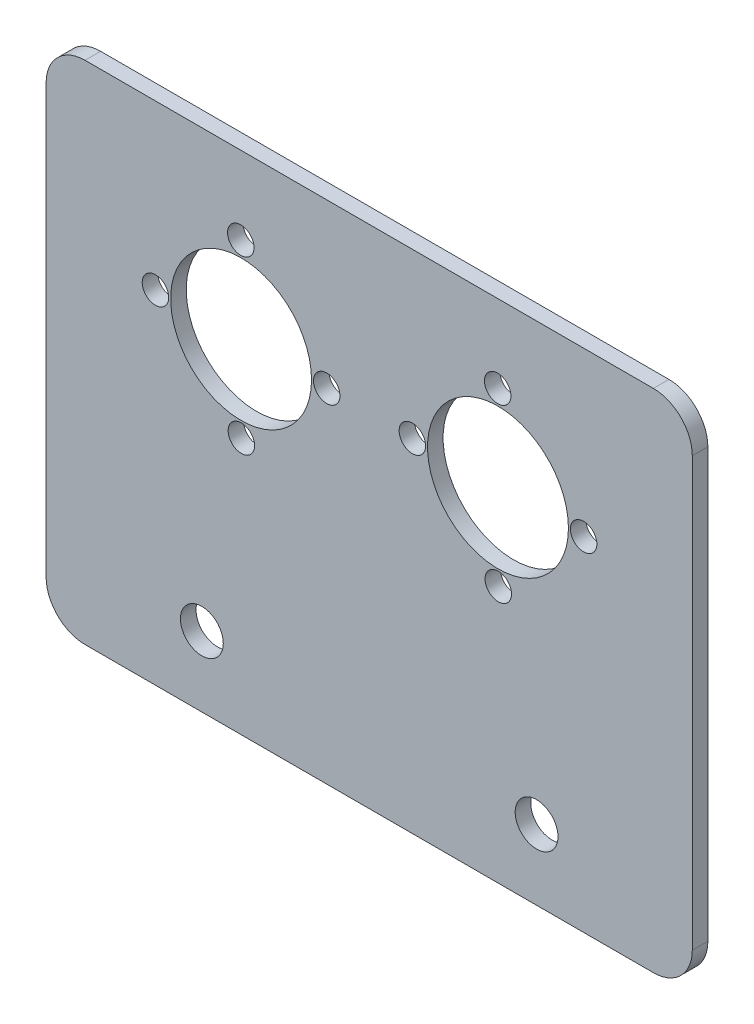
ISO-10303-21;
HEADER;
FILE_DESCRIPTION(('STEP AP214'),'2;1');
FILE_NAME('part.step','',(''),(''),'','','');
FILE_SCHEMA(('AUTOMOTIVE_DESIGN { 1 0 10303 214 1 1 1 1 }'));
ENDSEC;
DATA;
#1=APPLICATION_CONTEXT('core data for automotive mechanical design processes');
#2=APPLICATION_PROTOCOL_DEFINITION('international standard','automotive_design',2000,#1);
#3=PRODUCT_CONTEXT('',#1,'mechanical');
#4=PRODUCT('Part','Part','',(#3));
#5=PRODUCT_RELATED_PRODUCT_CATEGORY('part','',(#4));
#6=PRODUCT_DEFINITION_FORMATION('','',#4);
#7=PRODUCT_DEFINITION_CONTEXT('part definition',#1,'design');
#8=PRODUCT_DEFINITION('design','',#6,#7);
#9=PRODUCT_DEFINITION_SHAPE('','',#8);
#10=(LENGTH_UNIT() NAMED_UNIT(*) SI_UNIT(.MILLI.,.METRE.));
#11=(NAMED_UNIT(*) PLANE_ANGLE_UNIT() SI_UNIT($,.RADIAN.));
#12=(NAMED_UNIT(*) SI_UNIT($,.STERADIAN.) SOLID_ANGLE_UNIT());
#13=UNCERTAINTY_MEASURE_WITH_UNIT(LENGTH_MEASURE(1.E-05),#10,'distance_accuracy_value','');
#14=(GEOMETRIC_REPRESENTATION_CONTEXT(3) GLOBAL_UNCERTAINTY_ASSIGNED_CONTEXT((#13)) GLOBAL_UNIT_ASSIGNED_CONTEXT((#10,
#11,#12)) REPRESENTATION_CONTEXT('',''));
#15=CARTESIAN_POINT('',(0.,0.,0.));
#16=DIRECTION('',(0.,0.,1.));
#17=DIRECTION('',(1.,0.,0.));
#18=AXIS2_PLACEMENT_3D('',#15,#16,#17);
#19=CARTESIAN_POINT('',(41.5,-32.5,-2.));
#20=DIRECTION('',(1.,0.,0.));
#21=DIRECTION('',(0.,0.,-1.));
#22=AXIS2_PLACEMENT_3D('',#19,#20,#21);
#23=PLANE('',#22);
#24=DIRECTION('',(0.,1.,0.));
#25=VECTOR('',#24,1.);
#26=CARTESIAN_POINT('',(41.5,-32.5,0.));
#27=LINE('',#26,#25);
#28=CARTESIAN_POINT('',(41.5,-27.5,0.));
#29=VERTEX_POINT('',#28);
#30=CARTESIAN_POINT('',(41.5,27.5,0.));
#31=VERTEX_POINT('',#30);
#32=EDGE_CURVE('E158',#29,#31,#27,.T.);
#33=ORIENTED_EDGE('',*,*,#32,.F.);
#34=DIRECTION('',(0.,0.,1.));
#35=VECTOR('',#34,1.);
#36=CARTESIAN_POINT('',(41.5,-27.5,-2.));
#37=LINE('',#36,#35);
#38=CARTESIAN_POINT('',(41.5,-27.5,-2.));
#39=VERTEX_POINT('',#38);
#40=EDGE_CURVE('E149',#29,#39,#37,.F.);
#41=ORIENTED_EDGE('',*,*,#40,.T.);
#42=DIRECTION('',(0.,1.,0.));
#43=VECTOR('',#42,1.);
#44=CARTESIAN_POINT('',(41.5,-32.5,-2.));
#45=LINE('',#44,#43);
#46=CARTESIAN_POINT('',(41.5,27.5,-2.));
#47=VERTEX_POINT('',#46);
#48=EDGE_CURVE('E155',#39,#47,#45,.T.);
#49=ORIENTED_EDGE('',*,*,#48,.T.);
#50=DIRECTION('',(0.,0.,1.));
#51=VECTOR('',#50,1.);
#52=CARTESIAN_POINT('',(41.5,27.5,-2.));
#53=LINE('',#52,#51);
#54=EDGE_CURVE('E146',#47,#31,#53,.T.);
#55=ORIENTED_EDGE('',*,*,#54,.T.);
#56=EDGE_LOOP('',(#33,#41,#49,#55));
#57=FACE_BOUND('',#56,.T.);
#58=ADVANCED_FACE('F35',(#57),#23,.T.);
#59=CARTESIAN_POINT('',(-41.5,-32.5,-2.));
#60=DIRECTION('',(0.,-1.,0.));
#61=DIRECTION('',(0.,0.,-1.));
#62=AXIS2_PLACEMENT_3D('',#59,#60,#61);
#63=PLANE('',#62);
#64=DIRECTION('',(1.,0.,0.));
#65=VECTOR('',#64,1.);
#66=CARTESIAN_POINT('',(-41.5,-32.5,0.));
#67=LINE('',#66,#65);
#68=CARTESIAN_POINT('',(-36.5,-32.5,0.));
#69=VERTEX_POINT('',#68);
#70=CARTESIAN_POINT('',(36.5,-32.5,0.));
#71=VERTEX_POINT('',#70);
#72=EDGE_CURVE('E119',#69,#71,#67,.T.);
#73=ORIENTED_EDGE('',*,*,#72,.F.);
#74=DIRECTION('',(0.,0.,1.));
#75=VECTOR('',#74,1.);
#76=CARTESIAN_POINT('',(-36.5,-32.5,-2.));
#77=LINE('',#76,#75);
#78=CARTESIAN_POINT('',(-36.5,-32.5,-2.));
#79=VERTEX_POINT('',#78);
#80=EDGE_CURVE('E137',#69,#79,#77,.F.);
#81=ORIENTED_EDGE('',*,*,#80,.T.);
#82=DIRECTION('',(1.,0.,0.));
#83=VECTOR('',#82,1.);
#84=CARTESIAN_POINT('',(-41.5,-32.5,-2.));
#85=LINE('',#84,#83);
#86=CARTESIAN_POINT('',(36.5,-32.5,-2.));
#87=VERTEX_POINT('',#86);
#88=EDGE_CURVE('E122',#79,#87,#85,.T.);
#89=ORIENTED_EDGE('',*,*,#88,.T.);
#90=DIRECTION('',(0.,0.,1.));
#91=VECTOR('',#90,1.);
#92=CARTESIAN_POINT('',(36.5,-32.5,-2.));
#93=LINE('',#92,#91);
#94=EDGE_CURVE('E134',#87,#71,#93,.T.);
#95=ORIENTED_EDGE('',*,*,#94,.T.);
#96=EDGE_LOOP('',(#73,#81,#89,#95));
#97=FACE_BOUND('',#96,.T.);
#98=ADVANCED_FACE('F171',(#97),#63,.T.);
#99=CARTESIAN_POINT('',(-41.5,-32.5,-2.));
#100=DIRECTION('',(-1.,0.,0.));
#101=DIRECTION('',(0.,0.,1.));
#102=AXIS2_PLACEMENT_3D('',#99,#100,#101);
#103=PLANE('',#102);
#104=DIRECTION('',(0.,-1.,0.));
#105=VECTOR('',#104,1.);
#106=CARTESIAN_POINT('',(-41.5,-32.5,-2.));
#107=LINE('',#106,#105);
#108=CARTESIAN_POINT('',(-41.5,27.5,-2.));
#109=VERTEX_POINT('',#108);
#110=CARTESIAN_POINT('',(-41.5,-27.5,-2.));
#111=VERTEX_POINT('',#110);
#112=EDGE_CURVE('E126',#109,#111,#107,.T.);
#113=ORIENTED_EDGE('',*,*,#112,.T.);
#114=DIRECTION('',(0.,0.,1.));
#115=VECTOR('',#114,1.);
#116=CARTESIAN_POINT('',(-41.5,-27.5,-2.));
#117=LINE('',#116,#115);
#118=CARTESIAN_POINT('',(-41.5,-27.5,0.));
#119=VERTEX_POINT('',#118);
#120=EDGE_CURVE('E118',#111,#119,#117,.T.);
#121=ORIENTED_EDGE('',*,*,#120,.T.);
#122=DIRECTION('',(0.,-1.,0.));
#123=VECTOR('',#122,1.);
#124=CARTESIAN_POINT('',(-41.5,-32.5,0.));
#125=LINE('',#124,#123);
#126=CARTESIAN_POINT('',(-41.5,27.5,0.));
#127=VERTEX_POINT('',#126);
#128=EDGE_CURVE('E104',#127,#119,#125,.T.);
#129=ORIENTED_EDGE('',*,*,#128,.F.);
#130=DIRECTION('',(0.,0.,1.));
#131=VECTOR('',#130,1.);
#132=CARTESIAN_POINT('',(-41.5,27.5,-2.));
#133=LINE('',#132,#131);
#134=EDGE_CURVE('E116',#127,#109,#133,.F.);
#135=ORIENTED_EDGE('',*,*,#134,.T.);
#136=EDGE_LOOP('',(#113,#121,#129,#135));
#137=FACE_BOUND('',#136,.T.);
#138=ADVANCED_FACE('F115',(#137),#103,.T.);
#139=CARTESIAN_POINT('',(-41.5,32.5,-2.));
#140=DIRECTION('',(0.,1.,0.));
#141=DIRECTION('',(0.,0.,1.));
#142=AXIS2_PLACEMENT_3D('',#139,#140,#141);
#143=PLANE('',#142);
#144=DIRECTION('',(-1.,0.,0.));
#145=VECTOR('',#144,1.);
#146=CARTESIAN_POINT('',(-41.5,32.5,-2.));
#147=LINE('',#146,#145);
#148=CARTESIAN_POINT('',(36.5,32.5,-2.));
#149=VERTEX_POINT('',#148);
#150=CARTESIAN_POINT('',(-36.5,32.5,-2.));
#151=VERTEX_POINT('',#150);
#152=EDGE_CURVE('E164',#149,#151,#147,.T.);
#153=ORIENTED_EDGE('',*,*,#152,.T.);
#154=DIRECTION('',(0.,0.,1.));
#155=VECTOR('',#154,1.);
#156=CARTESIAN_POINT('',(-36.5,32.5,-2.));
#157=LINE('',#156,#155);
#158=CARTESIAN_POINT('',(-36.5,32.5,0.));
#159=VERTEX_POINT('',#158);
#160=EDGE_CURVE('E11',#151,#159,#157,.T.);
#161=ORIENTED_EDGE('',*,*,#160,.T.);
#162=DIRECTION('',(-1.,0.,0.));
#163=VECTOR('',#162,1.);
#164=CARTESIAN_POINT('',(-41.5,32.5,0.));
#165=LINE('',#164,#163);
#166=CARTESIAN_POINT('',(36.5,32.5,0.));
#167=VERTEX_POINT('',#166);
#168=EDGE_CURVE('E105',#167,#159,#165,.T.);
#169=ORIENTED_EDGE('',*,*,#168,.F.);
#170=DIRECTION('',(0.,0.,1.));
#171=VECTOR('',#170,1.);
#172=CARTESIAN_POINT('',(36.5,32.5,-2.));
#173=LINE('',#172,#171);
#174=EDGE_CURVE('E43',#167,#149,#173,.F.);
#175=ORIENTED_EDGE('',*,*,#174,.T.);
#176=EDGE_LOOP('',(#153,#161,#169,#175));
#177=FACE_BOUND('',#176,.T.);
#178=ADVANCED_FACE('F310',(#177),#143,.T.);
#179=CARTESIAN_POINT('',(0.,0.,-2.));
#180=DIRECTION('',(0.,0.,-1.));
#181=DIRECTION('',(-1.,0.,0.));
#182=AXIS2_PLACEMENT_3D('',#179,#180,#181);
#183=PLANE('',#182);
#184=CARTESIAN_POINT('',(21.5000000000001,-23.499999999983,-2.));
#185=DIRECTION('',(0.,0.,1.));
#186=DIRECTION('',(1.,0.,0.));
#187=AXIS2_PLACEMENT_3D('',#184,#185,#186);
#188=CIRCLE('',#187,2.75);
#189=CARTESIAN_POINT('',(24.2500000000001,-23.499999999983,-2.));
#190=VERTEX_POINT('',#189);
#191=EDGE_CURVE('E255',#190,#190,#188,.T.);
#192=ORIENTED_EDGE('',*,*,#191,.T.);
#193=EDGE_LOOP('',(#192));
#194=FACE_BOUND('',#193,.T.);
#195=CARTESIAN_POINT('',(-21.4969384566987,-23.499999999983,-2.));
#196=DIRECTION('',(0.,0.,1.));
#197=DIRECTION('',(1.,0.,0.));
#198=AXIS2_PLACEMENT_3D('',#195,#196,#197);
#199=CIRCLE('',#198,2.75);
#200=CARTESIAN_POINT('',(-18.7469384566987,-23.499999999983,-2.));
#201=VERTEX_POINT('',#200);
#202=EDGE_CURVE('E249',#201,#201,#199,.T.);
#203=ORIENTED_EDGE('',*,*,#202,.T.);
#204=EDGE_LOOP('',(#203));
#205=FACE_BOUND('',#204,.T.);
#206=CARTESIAN_POINT('',(-5.45897903742142,11.5358726856039,-2.));
#207=DIRECTION('',(0.,0.,1.));
#208=DIRECTION('',(1.,0.,0.));
#209=AXIS2_PLACEMENT_3D('',#206,#207,#208);
#210=CIRCLE('',#209,1.7);
#211=CARTESIAN_POINT('',(-3.75897903742142,11.5358726856039,-2.));
#212=VERTEX_POINT('',#211);
#213=EDGE_CURVE('E246',#212,#212,#210,.T.);
#214=ORIENTED_EDGE('',*,*,#213,.T.);
#215=EDGE_LOOP('',(#214));
#216=FACE_BOUND('',#215,.T.);
#217=CARTESIAN_POINT('',(-27.4588620507858,11.4641273144426,-2.));
#218=DIRECTION('',(0.,0.,1.));
#219=DIRECTION('',(1.,0.,0.));
#220=AXIS2_PLACEMENT_3D('',#217,#218,#219);
#221=CIRCLE('',#220,1.7);
#222=CARTESIAN_POINT('',(-25.7588620507858,11.4641273144426,-2.));
#223=VERTEX_POINT('',#222);
#224=EDGE_CURVE('E240',#223,#223,#221,.T.);
#225=ORIENTED_EDGE('',*,*,#224,.T.);
#226=EDGE_LOOP('',(#225));
#227=FACE_BOUND('',#226,.T.);
#228=CARTESIAN_POINT('',(-16.4230478585229,0.500058493341093,-2.));
#229=DIRECTION('',(0.,0.,1.));
#230=DIRECTION('',(1.,0.,0.));
#231=AXIS2_PLACEMENT_3D('',#228,#229,#230);
#232=CIRCLE('',#231,1.7);
#233=CARTESIAN_POINT('',(-14.7230478585229,0.500058493341093,-2.));
#234=VERTEX_POINT('',#233);
#235=EDGE_CURVE('E234',#234,#234,#232,.T.);
#236=ORIENTED_EDGE('',*,*,#235,.T.);
#237=EDGE_LOOP('',(#236));
#238=FACE_BOUND('',#237,.T.);
#239=CARTESIAN_POINT('',(-16.4947932296842,22.4999415067054,-2.));
#240=DIRECTION('',(0.,0.,1.));
#241=DIRECTION('',(1.,0.,0.));
#242=AXIS2_PLACEMENT_3D('',#239,#240,#241);
#243=CIRCLE('',#242,1.7);
#244=CARTESIAN_POINT('',(-14.7947932296842,22.4999415067054,-2.));
#245=VERTEX_POINT('',#244);
#246=EDGE_CURVE('E228',#245,#245,#243,.T.);
#247=ORIENTED_EDGE('',*,*,#246,.T.);
#248=EDGE_LOOP('',(#247));
#249=FACE_BOUND('',#248,.T.);
#250=CARTESIAN_POINT('',(16.5052067703158,22.4999415067054,-2.));
#251=DIRECTION('',(0.,0.,1.));
#252=DIRECTION('',(1.,0.,0.));
#253=AXIS2_PLACEMENT_3D('',#250,#251,#252);
#254=CIRCLE('',#253,1.7);
#255=CARTESIAN_POINT('',(18.2052067703158,22.4999415067054,-2.));
#256=VERTEX_POINT('',#255);
#257=EDGE_CURVE('E219',#256,#256,#254,.T.);
#258=ORIENTED_EDGE('',*,*,#257,.T.);
#259=EDGE_LOOP('',(#258));
#260=FACE_BOUND('',#259,.T.);
#261=CARTESIAN_POINT('',(27.5410209625786,11.5358726856039,-2.));
#262=DIRECTION('',(0.,0.,1.));
#263=DIRECTION('',(1.,0.,0.));
#264=AXIS2_PLACEMENT_3D('',#261,#262,#263);
#265=CIRCLE('',#264,1.7);
#266=CARTESIAN_POINT('',(29.2410209625786,11.5358726856039,-2.));
#267=VERTEX_POINT('',#266);
#268=EDGE_CURVE('E213',#267,#267,#265,.T.);
#269=ORIENTED_EDGE('',*,*,#268,.T.);
#270=EDGE_LOOP('',(#269));
#271=FACE_BOUND('',#270,.T.);
#272=CARTESIAN_POINT('',(5.54113794921425,11.4641273144426,-2.));
#273=DIRECTION('',(0.,0.,1.));
#274=DIRECTION('',(1.,0.,0.));
#275=AXIS2_PLACEMENT_3D('',#272,#273,#274);
#276=CIRCLE('',#275,1.7);
#277=CARTESIAN_POINT('',(7.24113794921425,11.4641273144426,-2.));
#278=VERTEX_POINT('',#277);
#279=EDGE_CURVE('E204',#278,#278,#276,.T.);
#280=ORIENTED_EDGE('',*,*,#279,.T.);
#281=EDGE_LOOP('',(#280));
#282=FACE_BOUND('',#281,.T.);
#283=CARTESIAN_POINT('',(16.5769521414771,0.500058493341093,-2.));
#284=DIRECTION('',(0.,0.,1.));
#285=DIRECTION('',(1.,0.,0.));
#286=AXIS2_PLACEMENT_3D('',#283,#284,#285);
#287=CIRCLE('',#286,1.7);
#288=CARTESIAN_POINT('',(18.2769521414771,0.500058493341093,-2.));
#289=VERTEX_POINT('',#288);
#290=EDGE_CURVE('E190',#289,#289,#287,.T.);
#291=ORIENTED_EDGE('',*,*,#290,.T.);
#292=EDGE_LOOP('',(#291));
#293=FACE_BOUND('',#292,.T.);
#294=CARTESIAN_POINT('',(16.5410794558972,11.5000000000059,-2.));
#295=DIRECTION('',(0.,0.,1.));
#296=DIRECTION('',(1.,0.,0.));
#297=AXIS2_PLACEMENT_3D('',#294,#295,#296);
#298=CIRCLE('',#297,9.05);
#299=CARTESIAN_POINT('',(25.5910794558972,11.5000000000059,-2.));
#300=VERTEX_POINT('',#299);
#301=EDGE_CURVE('E180',#300,#300,#298,.T.);
#302=ORIENTED_EDGE('',*,*,#301,.T.);
#303=EDGE_LOOP('',(#302));
#304=FACE_BOUND('',#303,.T.);
#305=CARTESIAN_POINT('',(-16.4589205441028,11.500000000006,-2.));
#306=DIRECTION('',(0.,0.,1.));
#307=DIRECTION('',(1.,0.,0.));
#308=AXIS2_PLACEMENT_3D('',#305,#306,#307);
#309=CIRCLE('',#308,9.05);
#310=CARTESIAN_POINT('',(-7.40892054410283,11.500000000006,-2.));
#311=VERTEX_POINT('',#310);
#312=EDGE_CURVE('E187',#311,#311,#309,.T.);
#313=ORIENTED_EDGE('',*,*,#312,.T.);
#314=EDGE_LOOP('',(#313));
#315=FACE_BOUND('',#314,.T.);
#316=ORIENTED_EDGE('',*,*,#88,.F.);
#317=CARTESIAN_POINT('',(-36.5,-27.5,-2.));
#318=DIRECTION('',(0.,0.,-1.));
#319=DIRECTION('',(-1.,0.,0.));
#320=AXIS2_PLACEMENT_3D('',#317,#318,#319);
#321=CIRCLE('',#320,5.);
#322=EDGE_CURVE('E144',#79,#111,#321,.T.);
#323=ORIENTED_EDGE('',*,*,#322,.T.);
#324=ORIENTED_EDGE('',*,*,#112,.F.);
#325=CARTESIAN_POINT('',(-36.5,27.5,-2.));
#326=DIRECTION('',(0.,0.,-1.));
#327=DIRECTION('',(-1.,0.,0.));
#328=AXIS2_PLACEMENT_3D('',#325,#326,#327);
#329=CIRCLE('',#328,5.);
#330=EDGE_CURVE('E50',#109,#151,#329,.T.);
#331=ORIENTED_EDGE('',*,*,#330,.T.);
#332=ORIENTED_EDGE('',*,*,#152,.F.);
#333=CARTESIAN_POINT('',(36.5,27.5,-2.));
#334=DIRECTION('',(0.,0.,-1.));
#335=DIRECTION('',(-1.,0.,0.));
#336=AXIS2_PLACEMENT_3D('',#333,#334,#335);
#337=CIRCLE('',#336,5.);
#338=EDGE_CURVE('E139',#149,#47,#337,.T.);
#339=ORIENTED_EDGE('',*,*,#338,.T.);
#340=ORIENTED_EDGE('',*,*,#48,.F.);
#341=CARTESIAN_POINT('',(36.5,-27.5,-2.));
#342=DIRECTION('',(0.,0.,-1.));
#343=DIRECTION('',(-1.,0.,0.));
#344=AXIS2_PLACEMENT_3D('',#341,#342,#343);
#345=CIRCLE('',#344,5.);
#346=EDGE_CURVE('E142',#39,#87,#345,.T.);
#347=ORIENTED_EDGE('',*,*,#346,.T.);
#348=EDGE_LOOP('',(#316,#323,#324,#331,#332,#339,#340,#347));
#349=FACE_BOUND('',#348,.T.);
#350=ADVANCED_FACE('F162',(#194,#205,#216,#227,#238,#249,#260,#271,#282,#293,#304,#315,#349),
#183,.T.);
#351=CARTESIAN_POINT('',(0.,0.,0.));
#352=DIRECTION('',(0.,0.,-1.));
#353=DIRECTION('',(-1.,0.,0.));
#354=AXIS2_PLACEMENT_3D('',#351,#352,#353);
#355=PLANE('',#354);
#356=CARTESIAN_POINT('',(21.5000000000001,-23.499999999983,0.));
#357=DIRECTION('',(0.,0.,1.));
#358=DIRECTION('',(1.,0.,0.));
#359=AXIS2_PLACEMENT_3D('',#356,#357,#358);
#360=CIRCLE('',#359,2.75);
#361=CARTESIAN_POINT('',(24.2500000000001,-23.499999999983,0.));
#362=VERTEX_POINT('',#361);
#363=EDGE_CURVE('E258',#362,#362,#360,.T.);
#364=ORIENTED_EDGE('',*,*,#363,.F.);
#365=EDGE_LOOP('',(#364));
#366=FACE_BOUND('',#365,.T.);
#367=CARTESIAN_POINT('',(-21.4969384566987,-23.499999999983,0.));
#368=DIRECTION('',(0.,0.,1.));
#369=DIRECTION('',(1.,0.,0.));
#370=AXIS2_PLACEMENT_3D('',#367,#368,#369);
#371=CIRCLE('',#370,2.75);
#372=CARTESIAN_POINT('',(-18.7469384566987,-23.499999999983,0.));
#373=VERTEX_POINT('',#372);
#374=EDGE_CURVE('E252',#373,#373,#371,.T.);
#375=ORIENTED_EDGE('',*,*,#374,.F.);
#376=EDGE_LOOP('',(#375));
#377=FACE_BOUND('',#376,.T.);
#378=CARTESIAN_POINT('',(-5.45897903742142,11.5358726856039,0.));
#379=DIRECTION('',(0.,0.,1.));
#380=DIRECTION('',(1.,0.,0.));
#381=AXIS2_PLACEMENT_3D('',#378,#379,#380);
#382=CIRCLE('',#381,1.7);
#383=CARTESIAN_POINT('',(-3.75897903742142,11.5358726856039,0.));
#384=VERTEX_POINT('',#383);
#385=EDGE_CURVE('E243',#384,#384,#382,.T.);
#386=ORIENTED_EDGE('',*,*,#385,.F.);
#387=EDGE_LOOP('',(#386));
#388=FACE_BOUND('',#387,.T.);
#389=CARTESIAN_POINT('',(-27.4588620507858,11.4641273144426,0.));
#390=DIRECTION('',(0.,0.,1.));
#391=DIRECTION('',(1.,0.,0.));
#392=AXIS2_PLACEMENT_3D('',#389,#390,#391);
#393=CIRCLE('',#392,1.7);
#394=CARTESIAN_POINT('',(-25.7588620507858,11.4641273144426,0.));
#395=VERTEX_POINT('',#394);
#396=EDGE_CURVE('E237',#395,#395,#393,.T.);
#397=ORIENTED_EDGE('',*,*,#396,.F.);
#398=EDGE_LOOP('',(#397));
#399=FACE_BOUND('',#398,.T.);
#400=CARTESIAN_POINT('',(-16.4230478585229,0.500058493341093,0.));
#401=DIRECTION('',(0.,0.,1.));
#402=DIRECTION('',(1.,0.,0.));
#403=AXIS2_PLACEMENT_3D('',#400,#401,#402);
#404=CIRCLE('',#403,1.7);
#405=CARTESIAN_POINT('',(-14.7230478585229,0.500058493341093,0.));
#406=VERTEX_POINT('',#405);
#407=EDGE_CURVE('E231',#406,#406,#404,.T.);
#408=ORIENTED_EDGE('',*,*,#407,.F.);
#409=EDGE_LOOP('',(#408));
#410=FACE_BOUND('',#409,.T.);
#411=CARTESIAN_POINT('',(-16.4947932296842,22.4999415067054,0.));
#412=DIRECTION('',(0.,0.,1.));
#413=DIRECTION('',(1.,0.,0.));
#414=AXIS2_PLACEMENT_3D('',#411,#412,#413);
#415=CIRCLE('',#414,1.7);
#416=CARTESIAN_POINT('',(-14.7947932296842,22.4999415067054,0.));
#417=VERTEX_POINT('',#416);
#418=EDGE_CURVE('E225',#417,#417,#415,.T.);
#419=ORIENTED_EDGE('',*,*,#418,.F.);
#420=EDGE_LOOP('',(#419));
#421=FACE_BOUND('',#420,.T.);
#422=CARTESIAN_POINT('',(16.5052067703158,22.4999415067054,0.));
#423=DIRECTION('',(0.,0.,1.));
#424=DIRECTION('',(1.,0.,0.));
#425=AXIS2_PLACEMENT_3D('',#422,#423,#424);
#426=CIRCLE('',#425,1.7);
#427=CARTESIAN_POINT('',(18.2052067703158,22.4999415067054,0.));
#428=VERTEX_POINT('',#427);
#429=EDGE_CURVE('E222',#428,#428,#426,.T.);
#430=ORIENTED_EDGE('',*,*,#429,.F.);
#431=EDGE_LOOP('',(#430));
#432=FACE_BOUND('',#431,.T.);
#433=CARTESIAN_POINT('',(27.5410209625786,11.5358726856039,0.));
#434=DIRECTION('',(0.,0.,1.));
#435=DIRECTION('',(1.,0.,0.));
#436=AXIS2_PLACEMENT_3D('',#433,#434,#435);
#437=CIRCLE('',#436,1.7);
#438=CARTESIAN_POINT('',(29.2410209625786,11.5358726856039,0.));
#439=VERTEX_POINT('',#438);
#440=EDGE_CURVE('E216',#439,#439,#437,.T.);
#441=ORIENTED_EDGE('',*,*,#440,.F.);
#442=EDGE_LOOP('',(#441));
#443=FACE_BOUND('',#442,.T.);
#444=CARTESIAN_POINT('',(5.54113794921425,11.4641273144426,0.));
#445=DIRECTION('',(0.,0.,1.));
#446=DIRECTION('',(1.,0.,0.));
#447=AXIS2_PLACEMENT_3D('',#444,#445,#446);
#448=CIRCLE('',#447,1.7);
#449=CARTESIAN_POINT('',(7.24113794921425,11.4641273144426,0.));
#450=VERTEX_POINT('',#449);
#451=EDGE_CURVE('E208',#450,#450,#448,.T.);
#452=ORIENTED_EDGE('',*,*,#451,.F.);
#453=EDGE_LOOP('',(#452));
#454=FACE_BOUND('',#453,.T.);
#455=CARTESIAN_POINT('',(16.5769521414771,0.500058493341093,0.));
#456=DIRECTION('',(0.,0.,1.));
#457=DIRECTION('',(1.,0.,0.));
#458=AXIS2_PLACEMENT_3D('',#455,#456,#457);
#459=CIRCLE('',#458,1.7);
#460=CARTESIAN_POINT('',(18.2769521414771,0.500058493341093,0.));
#461=VERTEX_POINT('',#460);
#462=EDGE_CURVE('E200',#461,#461,#459,.T.);
#463=ORIENTED_EDGE('',*,*,#462,.F.);
#464=EDGE_LOOP('',(#463));
#465=FACE_BOUND('',#464,.T.);
#466=CARTESIAN_POINT('',(16.5410794558972,11.5000000000059,0.));
#467=DIRECTION('',(0.,0.,1.));
#468=DIRECTION('',(1.,0.,0.));
#469=AXIS2_PLACEMENT_3D('',#466,#467,#468);
#470=CIRCLE('',#469,9.05);
#471=CARTESIAN_POINT('',(25.5910794558972,11.5000000000059,0.));
#472=VERTEX_POINT('',#471);
#473=EDGE_CURVE('E182',#472,#472,#470,.T.);
#474=ORIENTED_EDGE('',*,*,#473,.F.);
#475=EDGE_LOOP('',(#474));
#476=FACE_BOUND('',#475,.T.);
#477=CARTESIAN_POINT('',(-16.4589205441028,11.500000000006,0.));
#478=DIRECTION('',(0.,0.,1.));
#479=DIRECTION('',(1.,0.,0.));
#480=AXIS2_PLACEMENT_3D('',#477,#478,#479);
#481=CIRCLE('',#480,9.05);
#482=CARTESIAN_POINT('',(-7.40892054410283,11.500000000006,0.));
#483=VERTEX_POINT('',#482);
#484=EDGE_CURVE('E195',#483,#483,#481,.T.);
#485=ORIENTED_EDGE('',*,*,#484,.F.);
#486=EDGE_LOOP('',(#485));
#487=FACE_BOUND('',#486,.T.);
#488=ORIENTED_EDGE('',*,*,#128,.T.);
#489=CARTESIAN_POINT('',(-36.5,-27.5,0.));
#490=DIRECTION('',(0.,0.,-1.));
#491=DIRECTION('',(-1.,0.,0.));
#492=AXIS2_PLACEMENT_3D('',#489,#490,#491);
#493=CIRCLE('',#492,5.);
#494=EDGE_CURVE('E132',#119,#69,#493,.F.);
#495=ORIENTED_EDGE('',*,*,#494,.T.);
#496=ORIENTED_EDGE('',*,*,#72,.T.);
#497=CARTESIAN_POINT('',(36.5,-27.5,0.));
#498=DIRECTION('',(0.,0.,-1.));
#499=DIRECTION('',(-1.,0.,0.));
#500=AXIS2_PLACEMENT_3D('',#497,#498,#499);
#501=CIRCLE('',#500,5.);
#502=EDGE_CURVE('E109',#71,#29,#501,.F.);
#503=ORIENTED_EDGE('',*,*,#502,.T.);
#504=ORIENTED_EDGE('',*,*,#32,.T.);
#505=CARTESIAN_POINT('',(36.5,27.5,0.));
#506=DIRECTION('',(0.,0.,-1.));
#507=DIRECTION('',(-1.,0.,0.));
#508=AXIS2_PLACEMENT_3D('',#505,#506,#507);
#509=CIRCLE('',#508,5.);
#510=EDGE_CURVE('E110',#31,#167,#509,.F.);
#511=ORIENTED_EDGE('',*,*,#510,.T.);
#512=ORIENTED_EDGE('',*,*,#168,.T.);
#513=CARTESIAN_POINT('',(-36.5,27.5,0.));
#514=DIRECTION('',(0.,0.,-1.));
#515=DIRECTION('',(-1.,0.,0.));
#516=AXIS2_PLACEMENT_3D('',#513,#514,#515);
#517=CIRCLE('',#516,5.);
#518=EDGE_CURVE('E101',#159,#127,#517,.F.);
#519=ORIENTED_EDGE('',*,*,#518,.T.);
#520=EDGE_LOOP('',(#488,#495,#496,#503,#504,#511,#512,#519));
#521=FACE_BOUND('',#520,.T.);
#522=ADVANCED_FACE('F103',(#366,#377,#388,#399,#410,#421,#432,#443,#454,#465,#476,#487,#521),
#355,.F.);
#523=CARTESIAN_POINT('',(-16.4589205441028,11.500000000006,-2.));
#524=DIRECTION('',(0.,0.,1.));
#525=DIRECTION('',(1.,0.,0.));
#526=AXIS2_PLACEMENT_3D('',#523,#524,#525);
#527=CYLINDRICAL_SURFACE('',#526,9.05);
#528=ORIENTED_EDGE('',*,*,#312,.F.);
#529=EDGE_LOOP('',(#528));
#530=FACE_BOUND('',#529,.T.);
#531=ORIENTED_EDGE('',*,*,#484,.T.);
#532=EDGE_LOOP('',(#531));
#533=FACE_BOUND('',#532,.T.);
#534=ADVANCED_FACE('F266',(#530,#533),#527,.F.);
#535=CARTESIAN_POINT('',(16.5410794558972,11.5000000000059,-2.));
#536=DIRECTION('',(0.,0.,1.));
#537=DIRECTION('',(1.,0.,0.));
#538=AXIS2_PLACEMENT_3D('',#535,#536,#537);
#539=CYLINDRICAL_SURFACE('',#538,9.05);
#540=ORIENTED_EDGE('',*,*,#301,.F.);
#541=EDGE_LOOP('',(#540));
#542=FACE_BOUND('',#541,.T.);
#543=ORIENTED_EDGE('',*,*,#473,.T.);
#544=EDGE_LOOP('',(#543));
#545=FACE_BOUND('',#544,.T.);
#546=ADVANCED_FACE('F288',(#542,#545),#539,.F.);
#547=CARTESIAN_POINT('',(16.5769521414771,0.500058493341093,0.));
#548=DIRECTION('',(0.,0.,1.));
#549=DIRECTION('',(1.,0.,0.));
#550=AXIS2_PLACEMENT_3D('',#547,#548,#549);
#551=CYLINDRICAL_SURFACE('',#550,1.7);
#552=ORIENTED_EDGE('',*,*,#290,.F.);
#553=EDGE_LOOP('',(#552));
#554=FACE_BOUND('',#553,.T.);
#555=ORIENTED_EDGE('',*,*,#462,.T.);
#556=EDGE_LOOP('',(#555));
#557=FACE_BOUND('',#556,.T.);
#558=ADVANCED_FACE('F290',(#554,#557),#551,.F.);
#559=CARTESIAN_POINT('',(5.54113794921425,11.4641273144426,0.));
#560=DIRECTION('',(0.,0.,1.));
#561=DIRECTION('',(1.,0.,0.));
#562=AXIS2_PLACEMENT_3D('',#559,#560,#561);
#563=CYLINDRICAL_SURFACE('',#562,1.7);
#564=ORIENTED_EDGE('',*,*,#279,.F.);
#565=EDGE_LOOP('',(#564));
#566=FACE_BOUND('',#565,.T.);
#567=ORIENTED_EDGE('',*,*,#451,.T.);
#568=EDGE_LOOP('',(#567));
#569=FACE_BOUND('',#568,.T.);
#570=ADVANCED_FACE('F297',(#566,#569),#563,.F.);
#571=CARTESIAN_POINT('',(27.5410209625786,11.5358726856039,0.));
#572=DIRECTION('',(0.,0.,1.));
#573=DIRECTION('',(1.,0.,0.));
#574=AXIS2_PLACEMENT_3D('',#571,#572,#573);
#575=CYLINDRICAL_SURFACE('',#574,1.7);
#576=ORIENTED_EDGE('',*,*,#268,.F.);
#577=EDGE_LOOP('',(#576));
#578=FACE_BOUND('',#577,.T.);
#579=ORIENTED_EDGE('',*,*,#440,.T.);
#580=EDGE_LOOP('',(#579));
#581=FACE_BOUND('',#580,.T.);
#582=ADVANCED_FACE('F396',(#578,#581),#575,.F.);
#583=CARTESIAN_POINT('',(16.5052067703158,22.4999415067054,0.));
#584=DIRECTION('',(0.,0.,1.));
#585=DIRECTION('',(1.,0.,0.));
#586=AXIS2_PLACEMENT_3D('',#583,#584,#585);
#587=CYLINDRICAL_SURFACE('',#586,1.7);
#588=ORIENTED_EDGE('',*,*,#257,.F.);
#589=EDGE_LOOP('',(#588));
#590=FACE_BOUND('',#589,.T.);
#591=ORIENTED_EDGE('',*,*,#429,.T.);
#592=EDGE_LOOP('',(#591));
#593=FACE_BOUND('',#592,.T.);
#594=ADVANCED_FACE('F386',(#590,#593),#587,.F.);
#595=CARTESIAN_POINT('',(-16.4947932296842,22.4999415067054,0.));
#596=DIRECTION('',(0.,0.,1.));
#597=DIRECTION('',(1.,0.,0.));
#598=AXIS2_PLACEMENT_3D('',#595,#596,#597);
#599=CYLINDRICAL_SURFACE('',#598,1.7);
#600=ORIENTED_EDGE('',*,*,#246,.F.);
#601=EDGE_LOOP('',(#600));
#602=FACE_BOUND('',#601,.T.);
#603=ORIENTED_EDGE('',*,*,#418,.T.);
#604=EDGE_LOOP('',(#603));
#605=FACE_BOUND('',#604,.T.);
#606=ADVANCED_FACE('F376',(#602,#605),#599,.F.);
#607=CARTESIAN_POINT('',(-16.4230478585229,0.500058493341093,0.));
#608=DIRECTION('',(0.,0.,1.));
#609=DIRECTION('',(1.,0.,0.));
#610=AXIS2_PLACEMENT_3D('',#607,#608,#609);
#611=CYLINDRICAL_SURFACE('',#610,1.7);
#612=ORIENTED_EDGE('',*,*,#235,.F.);
#613=EDGE_LOOP('',(#612));
#614=FACE_BOUND('',#613,.T.);
#615=ORIENTED_EDGE('',*,*,#407,.T.);
#616=EDGE_LOOP('',(#615));
#617=FACE_BOUND('',#616,.T.);
#618=ADVANCED_FACE('F366',(#614,#617),#611,.F.);
#619=CARTESIAN_POINT('',(-27.4588620507858,11.4641273144426,0.));
#620=DIRECTION('',(0.,0.,1.));
#621=DIRECTION('',(1.,0.,0.));
#622=AXIS2_PLACEMENT_3D('',#619,#620,#621);
#623=CYLINDRICAL_SURFACE('',#622,1.7);
#624=ORIENTED_EDGE('',*,*,#224,.F.);
#625=EDGE_LOOP('',(#624));
#626=FACE_BOUND('',#625,.T.);
#627=ORIENTED_EDGE('',*,*,#396,.T.);
#628=EDGE_LOOP('',(#627));
#629=FACE_BOUND('',#628,.T.);
#630=ADVANCED_FACE('F355',(#626,#629),#623,.F.);
#631=CARTESIAN_POINT('',(-5.45897903742142,11.5358726856039,0.));
#632=DIRECTION('',(0.,0.,1.));
#633=DIRECTION('',(1.,0.,0.));
#634=AXIS2_PLACEMENT_3D('',#631,#632,#633);
#635=CYLINDRICAL_SURFACE('',#634,1.7);
#636=ORIENTED_EDGE('',*,*,#213,.F.);
#637=EDGE_LOOP('',(#636));
#638=FACE_BOUND('',#637,.T.);
#639=ORIENTED_EDGE('',*,*,#385,.T.);
#640=EDGE_LOOP('',(#639));
#641=FACE_BOUND('',#640,.T.);
#642=ADVANCED_FACE('F314',(#638,#641),#635,.F.);
#643=CARTESIAN_POINT('',(-36.5,-27.5,-2.));
#644=DIRECTION('',(0.,0.,1.));
#645=DIRECTION('',(1.,0.,0.));
#646=AXIS2_PLACEMENT_3D('',#643,#644,#645);
#647=CYLINDRICAL_SURFACE('',#646,5.);
#648=ORIENTED_EDGE('',*,*,#322,.F.);
#649=ORIENTED_EDGE('',*,*,#80,.F.);
#650=ORIENTED_EDGE('',*,*,#494,.F.);
#651=ORIENTED_EDGE('',*,*,#120,.F.);
#652=EDGE_LOOP('',(#648,#649,#650,#651));
#653=FACE_BOUND('',#652,.T.);
#654=ADVANCED_FACE('F175',(#653),#647,.T.);
#655=CARTESIAN_POINT('',(36.5,-27.5,-2.));
#656=DIRECTION('',(0.,0.,1.));
#657=DIRECTION('',(1.,0.,0.));
#658=AXIS2_PLACEMENT_3D('',#655,#656,#657);
#659=CYLINDRICAL_SURFACE('',#658,5.);
#660=ORIENTED_EDGE('',*,*,#346,.F.);
#661=ORIENTED_EDGE('',*,*,#40,.F.);
#662=ORIENTED_EDGE('',*,*,#502,.F.);
#663=ORIENTED_EDGE('',*,*,#94,.F.);
#664=EDGE_LOOP('',(#660,#661,#662,#663));
#665=FACE_BOUND('',#664,.T.);
#666=ADVANCED_FACE('F167',(#665),#659,.T.);
#667=CARTESIAN_POINT('',(-36.5,27.5,-2.));
#668=DIRECTION('',(0.,0.,1.));
#669=DIRECTION('',(1.,0.,0.));
#670=AXIS2_PLACEMENT_3D('',#667,#668,#669);
#671=CYLINDRICAL_SURFACE('',#670,5.);
#672=ORIENTED_EDGE('',*,*,#330,.F.);
#673=ORIENTED_EDGE('',*,*,#134,.F.);
#674=ORIENTED_EDGE('',*,*,#518,.F.);
#675=ORIENTED_EDGE('',*,*,#160,.F.);
#676=EDGE_LOOP('',(#672,#673,#674,#675));
#677=FACE_BOUND('',#676,.T.);
#678=ADVANCED_FACE('F121',(#677),#671,.T.);
#679=CARTESIAN_POINT('',(36.5,27.5,-2.));
#680=DIRECTION('',(0.,0.,1.));
#681=DIRECTION('',(1.,0.,0.));
#682=AXIS2_PLACEMENT_3D('',#679,#680,#681);
#683=CYLINDRICAL_SURFACE('',#682,5.);
#684=ORIENTED_EDGE('',*,*,#338,.F.);
#685=ORIENTED_EDGE('',*,*,#174,.F.);
#686=ORIENTED_EDGE('',*,*,#510,.F.);
#687=ORIENTED_EDGE('',*,*,#54,.F.);
#688=EDGE_LOOP('',(#684,#685,#686,#687));
#689=FACE_BOUND('',#688,.T.);
#690=ADVANCED_FACE('F37',(#689),#683,.T.);
#691=CARTESIAN_POINT('',(-21.4969384566987,-23.499999999983,0.));
#692=DIRECTION('',(0.,0.,1.));
#693=DIRECTION('',(1.,0.,0.));
#694=AXIS2_PLACEMENT_3D('',#691,#692,#693);
#695=CYLINDRICAL_SURFACE('',#694,2.75);
#696=ORIENTED_EDGE('',*,*,#202,.F.);
#697=EDGE_LOOP('',(#696));
#698=FACE_BOUND('',#697,.T.);
#699=ORIENTED_EDGE('',*,*,#374,.T.);
#700=EDGE_LOOP('',(#699));
#701=FACE_BOUND('',#700,.T.);
#702=ADVANCED_FACE('F320',(#698,#701),#695,.F.);
#703=CARTESIAN_POINT('',(21.5000000000001,-23.499999999983,0.));
#704=DIRECTION('',(0.,0.,1.));
#705=DIRECTION('',(1.,0.,0.));
#706=AXIS2_PLACEMENT_3D('',#703,#704,#705);
#707=CYLINDRICAL_SURFACE('',#706,2.75);
#708=ORIENTED_EDGE('',*,*,#191,.F.);
#709=EDGE_LOOP('',(#708));
#710=FACE_BOUND('',#709,.T.);
#711=ORIENTED_EDGE('',*,*,#363,.T.);
#712=EDGE_LOOP('',(#711));
#713=FACE_BOUND('',#712,.T.);
#714=ADVANCED_FACE('F262',(#710,#713),#707,.F.);
#715=CLOSED_SHELL('',(#58,#98,#138,#178,#350,#522,#534,#546,#558,#570,#582,#594,#606,#618,#630,
#642,#654,#666,#678,#690,#702,#714));
#716=MANIFOLD_SOLID_BREP('B2',#715);
#717=ADVANCED_BREP_SHAPE_REPRESENTATION('',(#18,#716),#14);
#718=SHAPE_DEFINITION_REPRESENTATION(#9,#717);
ENDSEC;
END-ISO-10303-21;
